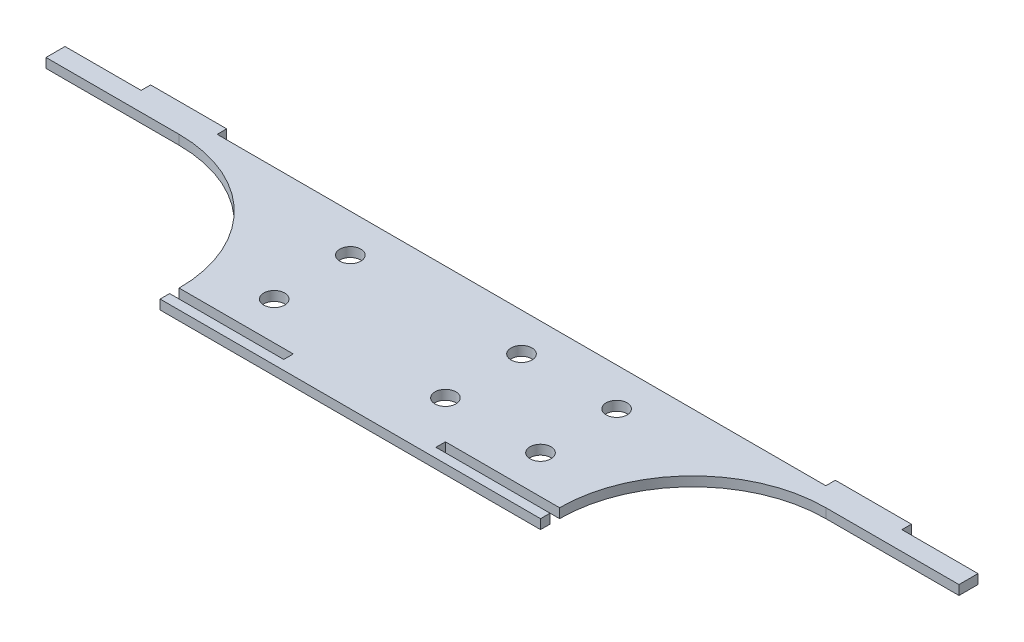
ISO-10303-21;
HEADER;
FILE_DESCRIPTION(('STEP AP214'),'2;1');
FILE_NAME('part.step','',(''),(''),'','','');
FILE_SCHEMA(('AUTOMOTIVE_DESIGN { 1 0 10303 214 1 1 1 1 }'));
ENDSEC;
DATA;
#1=APPLICATION_CONTEXT('core data for automotive mechanical design processes');
#2=APPLICATION_PROTOCOL_DEFINITION('international standard','automotive_design',2000,#1);
#3=PRODUCT_CONTEXT('',#1,'mechanical');
#4=PRODUCT('Part','Part','',(#3));
#5=PRODUCT_RELATED_PRODUCT_CATEGORY('part','',(#4));
#6=PRODUCT_DEFINITION_FORMATION('','',#4);
#7=PRODUCT_DEFINITION_CONTEXT('part definition',#1,'design');
#8=PRODUCT_DEFINITION('design','',#6,#7);
#9=PRODUCT_DEFINITION_SHAPE('','',#8);
#10=(LENGTH_UNIT() NAMED_UNIT(*) SI_UNIT(.MILLI.,.METRE.));
#11=(NAMED_UNIT(*) PLANE_ANGLE_UNIT() SI_UNIT($,.RADIAN.));
#12=(NAMED_UNIT(*) SI_UNIT($,.STERADIAN.) SOLID_ANGLE_UNIT());
#13=UNCERTAINTY_MEASURE_WITH_UNIT(LENGTH_MEASURE(1.E-05),#10,'distance_accuracy_value','');
#14=(GEOMETRIC_REPRESENTATION_CONTEXT(3) GLOBAL_UNCERTAINTY_ASSIGNED_CONTEXT((#13)) GLOBAL_UNIT_ASSIGNED_CONTEXT((#10,
#11,#12)) REPRESENTATION_CONTEXT('',''));
#15=CARTESIAN_POINT('',(0.,0.,0.));
#16=DIRECTION('',(0.,0.,1.));
#17=DIRECTION('',(1.,0.,0.));
#18=AXIS2_PLACEMENT_3D('',#15,#16,#17);
#19=CARTESIAN_POINT('',(0.,3.175,-19.05));
#20=DIRECTION('',(0.,0.,1.));
#21=DIRECTION('',(1.,0.,0.));
#22=AXIS2_PLACEMENT_3D('',#19,#20,#21);
#23=PLANE('',#22);
#24=DIRECTION('',(-1.,0.,0.));
#25=VECTOR('',#24,1.);
#26=CARTESIAN_POINT('',(0.,0.,-19.05));
#27=LINE('',#26,#25);
#28=CARTESIAN_POINT('',(-107.95,0.,-19.05));
#29=VERTEX_POINT('',#28);
#30=CARTESIAN_POINT('',(-152.4,0.,-19.05));
#31=VERTEX_POINT('',#30);
#32=EDGE_CURVE('E327',#29,#31,#27,.T.);
#33=ORIENTED_EDGE('',*,*,#32,.F.);
#34=DIRECTION('',(0.,-1.,0.));
#35=VECTOR('',#34,1.);
#36=CARTESIAN_POINT('',(-107.95,3.175,-19.05));
#37=LINE('',#36,#35);
#38=CARTESIAN_POINT('',(-107.95,3.175,-19.05));
#39=VERTEX_POINT('',#38);
#40=EDGE_CURVE('E343',#39,#29,#37,.T.);
#41=ORIENTED_EDGE('',*,*,#40,.F.);
#42=DIRECTION('',(-1.,0.,0.));
#43=VECTOR('',#42,1.);
#44=CARTESIAN_POINT('',(0.,3.175,-19.05));
#45=LINE('',#44,#43);
#46=CARTESIAN_POINT('',(-152.4,3.175,-19.05));
#47=VERTEX_POINT('',#46);
#48=EDGE_CURVE('E282',#39,#47,#45,.T.);
#49=ORIENTED_EDGE('',*,*,#48,.T.);
#50=DIRECTION('',(0.,-1.,0.));
#51=VECTOR('',#50,1.);
#52=CARTESIAN_POINT('',(-152.4,3.175,-19.05));
#53=LINE('',#52,#51);
#54=EDGE_CURVE('E346',#47,#31,#53,.T.);
#55=ORIENTED_EDGE('',*,*,#54,.T.);
#56=EDGE_LOOP('',(#33,#41,#49,#55));
#57=FACE_BOUND('',#56,.T.);
#58=ADVANCED_FACE('F115',(#57),#23,.T.);
#59=CARTESIAN_POINT('',(0.,3.175,-19.05));
#60=DIRECTION('',(0.,0.,1.));
#61=DIRECTION('',(1.,0.,0.));
#62=AXIS2_PLACEMENT_3D('',#59,#60,#61);
#63=PLANE('',#62);
#64=DIRECTION('',(-1.,0.,0.));
#65=VECTOR('',#64,1.);
#66=CARTESIAN_POINT('',(0.,0.,-19.05));
#67=LINE('',#66,#65);
#68=CARTESIAN_POINT('',(152.4,0.,-19.05));
#69=VERTEX_POINT('',#68);
#70=CARTESIAN_POINT('',(107.95,0.,-19.05));
#71=VERTEX_POINT('',#70);
#72=EDGE_CURVE('E314',#69,#71,#67,.T.);
#73=ORIENTED_EDGE('',*,*,#72,.F.);
#74=DIRECTION('',(0.,-1.,0.));
#75=VECTOR('',#74,1.);
#76=CARTESIAN_POINT('',(152.4,3.175,-19.05));
#77=LINE('',#76,#75);
#78=CARTESIAN_POINT('',(152.4,3.175,-19.05));
#79=VERTEX_POINT('',#78);
#80=EDGE_CURVE('E355',#79,#69,#77,.T.);
#81=ORIENTED_EDGE('',*,*,#80,.F.);
#82=DIRECTION('',(-1.,0.,0.));
#83=VECTOR('',#82,1.);
#84=CARTESIAN_POINT('',(0.,3.175,-19.05));
#85=LINE('',#84,#83);
#86=CARTESIAN_POINT('',(107.95,3.175,-19.05));
#87=VERTEX_POINT('',#86);
#88=EDGE_CURVE('E493',#79,#87,#85,.T.);
#89=ORIENTED_EDGE('',*,*,#88,.T.);
#90=DIRECTION('',(0.,-1.,0.));
#91=VECTOR('',#90,1.);
#92=CARTESIAN_POINT('',(107.95,3.175,-19.05));
#93=LINE('',#92,#91);
#94=EDGE_CURVE('E358',#87,#71,#93,.T.);
#95=ORIENTED_EDGE('',*,*,#94,.T.);
#96=EDGE_LOOP('',(#73,#81,#89,#95));
#97=FACE_BOUND('',#96,.T.);
#98=ADVANCED_FACE('F487',(#97),#63,.T.);
#99=CARTESIAN_POINT('',(-44.45,3.175,-12.7));
#100=DIRECTION('',(0.,-1.,0.));
#101=DIRECTION('',(0.,0.,-1.));
#102=AXIS2_PLACEMENT_3D('',#99,#100,#101);
#103=CYLINDRICAL_SURFACE('',#102,3.5);
#104=CARTESIAN_POINT('',(-44.45,3.175,-12.7));
#105=DIRECTION('',(0.,1.,0.));
#106=DIRECTION('',(0.,0.,1.));
#107=AXIS2_PLACEMENT_3D('',#104,#105,#106);
#108=CIRCLE('',#107,3.5);
#109=CARTESIAN_POINT('',(-44.45,3.175,-9.2));
#110=VERTEX_POINT('',#109);
#111=EDGE_CURVE('E551',#110,#110,#108,.T.);
#112=ORIENTED_EDGE('',*,*,#111,.T.);
#113=EDGE_LOOP('',(#112));
#114=FACE_BOUND('',#113,.T.);
#115=CARTESIAN_POINT('',(-44.45,0.,-12.7));
#116=DIRECTION('',(0.,1.,0.));
#117=DIRECTION('',(0.,0.,1.));
#118=AXIS2_PLACEMENT_3D('',#115,#116,#117);
#119=CIRCLE('',#118,3.5);
#120=CARTESIAN_POINT('',(-44.45,0.,-9.2));
#121=VERTEX_POINT('',#120);
#122=EDGE_CURVE('E309',#121,#121,#119,.T.);
#123=ORIENTED_EDGE('',*,*,#122,.F.);
#124=EDGE_LOOP('',(#123));
#125=FACE_BOUND('',#124,.T.);
#126=ADVANCED_FACE('F587',(#114,#125),#103,.F.);
#127=CARTESIAN_POINT('',(-44.45,3.175,12.7));
#128=DIRECTION('',(0.,-1.,0.));
#129=DIRECTION('',(0.,0.,-1.));
#130=AXIS2_PLACEMENT_3D('',#127,#128,#129);
#131=CYLINDRICAL_SURFACE('',#130,3.5);
#132=CARTESIAN_POINT('',(-44.45,3.175,12.7));
#133=DIRECTION('',(0.,1.,0.));
#134=DIRECTION('',(0.,0.,1.));
#135=AXIS2_PLACEMENT_3D('',#132,#133,#134);
#136=CIRCLE('',#135,3.5);
#137=CARTESIAN_POINT('',(-44.45,3.175,16.2));
#138=VERTEX_POINT('',#137);
#139=EDGE_CURVE('E554',#138,#138,#136,.T.);
#140=ORIENTED_EDGE('',*,*,#139,.T.);
#141=EDGE_LOOP('',(#140));
#142=FACE_BOUND('',#141,.T.);
#143=CARTESIAN_POINT('',(-44.45,0.,12.7));
#144=DIRECTION('',(0.,1.,0.));
#145=DIRECTION('',(0.,0.,1.));
#146=AXIS2_PLACEMENT_3D('',#143,#144,#145);
#147=CIRCLE('',#146,3.5);
#148=CARTESIAN_POINT('',(-44.45,0.,16.2));
#149=VERTEX_POINT('',#148);
#150=EDGE_CURVE('E306',#149,#149,#147,.T.);
#151=ORIENTED_EDGE('',*,*,#150,.F.);
#152=EDGE_LOOP('',(#151));
#153=FACE_BOUND('',#152,.T.);
#154=ADVANCED_FACE('F590',(#142,#153),#131,.F.);
#155=CARTESIAN_POINT('',(44.45,3.175,-12.7));
#156=DIRECTION('',(0.,-1.,0.));
#157=DIRECTION('',(0.,0.,-1.));
#158=AXIS2_PLACEMENT_3D('',#155,#156,#157);
#159=CYLINDRICAL_SURFACE('',#158,3.5);
#160=CARTESIAN_POINT('',(44.45,3.175,-12.7));
#161=DIRECTION('',(0.,1.,0.));
#162=DIRECTION('',(0.,0.,1.));
#163=AXIS2_PLACEMENT_3D('',#160,#161,#162);
#164=CIRCLE('',#163,3.5);
#165=CARTESIAN_POINT('',(44.45,3.175,-9.2));
#166=VERTEX_POINT('',#165);
#167=EDGE_CURVE('E559',#166,#166,#164,.T.);
#168=ORIENTED_EDGE('',*,*,#167,.T.);
#169=EDGE_LOOP('',(#168));
#170=FACE_BOUND('',#169,.T.);
#171=CARTESIAN_POINT('',(44.45,0.,-12.7));
#172=DIRECTION('',(0.,1.,0.));
#173=DIRECTION('',(0.,0.,1.));
#174=AXIS2_PLACEMENT_3D('',#171,#172,#173);
#175=CIRCLE('',#174,3.5);
#176=CARTESIAN_POINT('',(44.45,0.,-9.2));
#177=VERTEX_POINT('',#176);
#178=EDGE_CURVE('E303',#177,#177,#175,.T.);
#179=ORIENTED_EDGE('',*,*,#178,.F.);
#180=EDGE_LOOP('',(#179));
#181=FACE_BOUND('',#180,.T.);
#182=ADVANCED_FACE('F620',(#170,#181),#159,.F.);
#183=CARTESIAN_POINT('',(44.45,3.175,12.7));
#184=DIRECTION('',(0.,-1.,0.));
#185=DIRECTION('',(0.,0.,-1.));
#186=AXIS2_PLACEMENT_3D('',#183,#184,#185);
#187=CYLINDRICAL_SURFACE('',#186,3.5);
#188=CARTESIAN_POINT('',(44.45,3.175,12.7));
#189=DIRECTION('',(0.,1.,0.));
#190=DIRECTION('',(0.,0.,1.));
#191=AXIS2_PLACEMENT_3D('',#188,#189,#190);
#192=CIRCLE('',#191,3.5);
#193=CARTESIAN_POINT('',(44.45,3.175,16.2));
#194=VERTEX_POINT('',#193);
#195=EDGE_CURVE('E562',#194,#194,#192,.T.);
#196=ORIENTED_EDGE('',*,*,#195,.T.);
#197=EDGE_LOOP('',(#196));
#198=FACE_BOUND('',#197,.T.);
#199=CARTESIAN_POINT('',(44.45,0.,12.7));
#200=DIRECTION('',(0.,1.,0.));
#201=DIRECTION('',(0.,0.,1.));
#202=AXIS2_PLACEMENT_3D('',#199,#200,#201);
#203=CIRCLE('',#202,3.5);
#204=CARTESIAN_POINT('',(44.45,0.,16.2));
#205=VERTEX_POINT('',#204);
#206=EDGE_CURVE('E300',#205,#205,#203,.T.);
#207=ORIENTED_EDGE('',*,*,#206,.F.);
#208=EDGE_LOOP('',(#207));
#209=FACE_BOUND('',#208,.T.);
#210=ADVANCED_FACE('F624',(#198,#209),#187,.F.);
#211=CARTESIAN_POINT('',(12.7,3.175,-12.7));
#212=DIRECTION('',(0.,-1.,0.));
#213=DIRECTION('',(0.,0.,-1.));
#214=AXIS2_PLACEMENT_3D('',#211,#212,#213);
#215=CYLINDRICAL_SURFACE('',#214,3.5);
#216=CARTESIAN_POINT('',(12.7,3.175,-12.7));
#217=DIRECTION('',(0.,1.,0.));
#218=DIRECTION('',(0.,0.,1.));
#219=AXIS2_PLACEMENT_3D('',#216,#217,#218);
#220=CIRCLE('',#219,3.5);
#221=CARTESIAN_POINT('',(12.7,3.175,-9.2));
#222=VERTEX_POINT('',#221);
#223=EDGE_CURVE('E565',#222,#222,#220,.T.);
#224=ORIENTED_EDGE('',*,*,#223,.T.);
#225=EDGE_LOOP('',(#224));
#226=FACE_BOUND('',#225,.T.);
#227=CARTESIAN_POINT('',(12.7,0.,-12.7));
#228=DIRECTION('',(0.,1.,0.));
#229=DIRECTION('',(0.,0.,1.));
#230=AXIS2_PLACEMENT_3D('',#227,#228,#229);
#231=CIRCLE('',#230,3.5);
#232=CARTESIAN_POINT('',(12.7,0.,-9.2));
#233=VERTEX_POINT('',#232);
#234=EDGE_CURVE('E296',#233,#233,#231,.T.);
#235=ORIENTED_EDGE('',*,*,#234,.F.);
#236=EDGE_LOOP('',(#235));
#237=FACE_BOUND('',#236,.T.);
#238=ADVANCED_FACE('F628',(#226,#237),#215,.F.);
#239=CARTESIAN_POINT('',(12.7,3.175,12.7));
#240=DIRECTION('',(0.,-1.,0.));
#241=DIRECTION('',(0.,0.,-1.));
#242=AXIS2_PLACEMENT_3D('',#239,#240,#241);
#243=CYLINDRICAL_SURFACE('',#242,3.5);
#244=CARTESIAN_POINT('',(12.7,3.175,12.7));
#245=DIRECTION('',(0.,1.,0.));
#246=DIRECTION('',(0.,0.,1.));
#247=AXIS2_PLACEMENT_3D('',#244,#245,#246);
#248=CIRCLE('',#247,3.5);
#249=CARTESIAN_POINT('',(12.7,3.175,16.2));
#250=VERTEX_POINT('',#249);
#251=EDGE_CURVE('E337',#250,#250,#248,.T.);
#252=ORIENTED_EDGE('',*,*,#251,.T.);
#253=EDGE_LOOP('',(#252));
#254=FACE_BOUND('',#253,.T.);
#255=CARTESIAN_POINT('',(12.7,0.,12.7));
#256=DIRECTION('',(0.,1.,0.));
#257=DIRECTION('',(0.,0.,1.));
#258=AXIS2_PLACEMENT_3D('',#255,#256,#257);
#259=CIRCLE('',#258,3.5);
#260=CARTESIAN_POINT('',(12.7,0.,16.2));
#261=VERTEX_POINT('',#260);
#262=EDGE_CURVE('E293',#261,#261,#259,.T.);
#263=ORIENTED_EDGE('',*,*,#262,.F.);
#264=EDGE_LOOP('',(#263));
#265=FACE_BOUND('',#264,.T.);
#266=ADVANCED_FACE('F571',(#254,#265),#243,.F.);
#267=CARTESIAN_POINT('',(-152.4,3.175,0.));
#268=DIRECTION('',(-1.,0.,0.));
#269=DIRECTION('',(0.,0.,1.));
#270=AXIS2_PLACEMENT_3D('',#267,#268,#269);
#271=PLANE('',#270);
#272=DIRECTION('',(0.,0.,-1.));
#273=VECTOR('',#272,1.);
#274=CARTESIAN_POINT('',(-152.4,0.,0.));
#275=LINE('',#274,#273);
#276=CARTESIAN_POINT('',(-152.4,0.,-25.4));
#277=VERTEX_POINT('',#276);
#278=EDGE_CURVE('E324',#31,#277,#275,.T.);
#279=ORIENTED_EDGE('',*,*,#278,.F.);
#280=ORIENTED_EDGE('',*,*,#54,.F.);
#281=DIRECTION('',(0.,0.,-1.));
#282=VECTOR('',#281,1.);
#283=CARTESIAN_POINT('',(-152.4,3.175,0.));
#284=LINE('',#283,#282);
#285=CARTESIAN_POINT('',(-152.4,3.175,-25.4));
#286=VERTEX_POINT('',#285);
#287=EDGE_CURVE('E275',#47,#286,#284,.T.);
#288=ORIENTED_EDGE('',*,*,#287,.T.);
#289=DIRECTION('',(0.,-1.,0.));
#290=VECTOR('',#289,1.);
#291=CARTESIAN_POINT('',(-152.4,3.175,-25.4));
#292=LINE('',#291,#290);
#293=EDGE_CURVE('E349',#286,#277,#292,.T.);
#294=ORIENTED_EDGE('',*,*,#293,.T.);
#295=EDGE_LOOP('',(#279,#280,#288,#294));
#296=FACE_BOUND('',#295,.T.);
#297=ADVANCED_FACE('F441',(#296),#271,.T.);
#298=CARTESIAN_POINT('',(152.4,3.175,0.));
#299=DIRECTION('',(-1.,0.,0.));
#300=DIRECTION('',(0.,0.,1.));
#301=AXIS2_PLACEMENT_3D('',#298,#299,#300);
#302=PLANE('',#301);
#303=DIRECTION('',(0.,0.,-1.));
#304=VECTOR('',#303,1.);
#305=CARTESIAN_POINT('',(152.4,0.,0.));
#306=LINE('',#305,#304);
#307=CARTESIAN_POINT('',(152.4,0.,-25.4));
#308=VERTEX_POINT('',#307);
#309=EDGE_CURVE('E317',#69,#308,#306,.T.);
#310=ORIENTED_EDGE('',*,*,#309,.T.);
#311=DIRECTION('',(0.,-1.,0.));
#312=VECTOR('',#311,1.);
#313=CARTESIAN_POINT('',(152.4,3.175,-25.4));
#314=LINE('',#313,#312);
#315=CARTESIAN_POINT('',(152.4,3.175,-25.4));
#316=VERTEX_POINT('',#315);
#317=EDGE_CURVE('E352',#316,#308,#314,.T.);
#318=ORIENTED_EDGE('',*,*,#317,.F.);
#319=DIRECTION('',(0.,0.,-1.));
#320=VECTOR('',#319,1.);
#321=CARTESIAN_POINT('',(152.4,3.175,0.));
#322=LINE('',#321,#320);
#323=EDGE_CURVE('E276',#79,#316,#322,.T.);
#324=ORIENTED_EDGE('',*,*,#323,.F.);
#325=ORIENTED_EDGE('',*,*,#80,.T.);
#326=EDGE_LOOP('',(#310,#318,#324,#325));
#327=FACE_BOUND('',#326,.T.);
#328=ADVANCED_FACE('F483',(#327),#302,.F.);
#329=CARTESIAN_POINT('',(-107.95,3.175,25.4));
#330=DIRECTION('',(0.,-1.,0.));
#331=DIRECTION('',(0.,0.,-1.));
#332=AXIS2_PLACEMENT_3D('',#329,#330,#331);
#333=CYLINDRICAL_SURFACE('',#332,44.45);
#334=CARTESIAN_POINT('',(-107.95,0.,25.4));
#335=DIRECTION('',(0.,1.,0.));
#336=DIRECTION('',(0.,0.,1.));
#337=AXIS2_PLACEMENT_3D('',#334,#335,#336);
#338=CIRCLE('',#337,44.45);
#339=CARTESIAN_POINT('',(-63.5,0.,25.4));
#340=VERTEX_POINT('',#339);
#341=EDGE_CURVE('E330',#29,#340,#338,.F.);
#342=ORIENTED_EDGE('',*,*,#341,.T.);
#343=DIRECTION('',(0.,-1.,0.));
#344=VECTOR('',#343,1.);
#345=CARTESIAN_POINT('',(-63.5,3.175,25.4));
#346=LINE('',#345,#344);
#347=CARTESIAN_POINT('',(-63.5,3.175,25.4));
#348=VERTEX_POINT('',#347);
#349=EDGE_CURVE('E340',#348,#340,#346,.T.);
#350=ORIENTED_EDGE('',*,*,#349,.F.);
#351=CARTESIAN_POINT('',(-107.95,3.175,25.4));
#352=DIRECTION('',(0.,1.,0.));
#353=DIRECTION('',(0.,0.,1.));
#354=AXIS2_PLACEMENT_3D('',#351,#352,#353);
#355=CIRCLE('',#354,44.45);
#356=EDGE_CURVE('E285',#39,#348,#355,.F.);
#357=ORIENTED_EDGE('',*,*,#356,.F.);
#358=ORIENTED_EDGE('',*,*,#40,.T.);
#359=EDGE_LOOP('',(#342,#350,#357,#358));
#360=FACE_BOUND('',#359,.T.);
#361=ADVANCED_FACE('F600',(#360),#333,.F.);
#362=CARTESIAN_POINT('',(107.95,3.175,25.4));
#363=DIRECTION('',(0.,-1.,0.));
#364=DIRECTION('',(0.,0.,-1.));
#365=AXIS2_PLACEMENT_3D('',#362,#363,#364);
#366=CYLINDRICAL_SURFACE('',#365,44.45);
#367=CARTESIAN_POINT('',(107.95,0.,25.4));
#368=DIRECTION('',(0.,1.,0.));
#369=DIRECTION('',(0.,0.,1.));
#370=AXIS2_PLACEMENT_3D('',#367,#368,#369);
#371=CIRCLE('',#370,44.45);
#372=CARTESIAN_POINT('',(63.5,0.,25.4));
#373=VERTEX_POINT('',#372);
#374=EDGE_CURVE('E312',#71,#373,#371,.T.);
#375=ORIENTED_EDGE('',*,*,#374,.F.);
#376=ORIENTED_EDGE('',*,*,#94,.F.);
#377=CARTESIAN_POINT('',(107.95,3.175,25.4));
#378=DIRECTION('',(0.,1.,0.));
#379=DIRECTION('',(0.,0.,1.));
#380=AXIS2_PLACEMENT_3D('',#377,#378,#379);
#381=CIRCLE('',#380,44.45);
#382=CARTESIAN_POINT('',(63.5,3.175,25.4));
#383=VERTEX_POINT('',#382);
#384=EDGE_CURVE('E549',#87,#383,#381,.T.);
#385=ORIENTED_EDGE('',*,*,#384,.T.);
#386=DIRECTION('',(0.,-1.,0.));
#387=VECTOR('',#386,1.);
#388=CARTESIAN_POINT('',(63.5,3.175,25.4));
#389=LINE('',#388,#387);
#390=EDGE_CURVE('E292',#383,#373,#389,.T.);
#391=ORIENTED_EDGE('',*,*,#390,.T.);
#392=EDGE_LOOP('',(#375,#376,#385,#391));
#393=FACE_BOUND('',#392,.T.);
#394=ADVANCED_FACE('F497',(#393),#366,.F.);
#395=CARTESIAN_POINT('',(0.,0.,0.));
#396=DIRECTION('',(0.,1.,0.));
#397=DIRECTION('',(0.,0.,1.));
#398=AXIS2_PLACEMENT_3D('',#395,#396,#397);
#399=PLANE('',#398);
#400=ORIENTED_EDGE('',*,*,#262,.T.);
#401=EDGE_LOOP('',(#400));
#402=FACE_BOUND('',#401,.T.);
#403=ORIENTED_EDGE('',*,*,#234,.T.);
#404=EDGE_LOOP('',(#403));
#405=FACE_BOUND('',#404,.T.);
#406=ORIENTED_EDGE('',*,*,#206,.T.);
#407=EDGE_LOOP('',(#406));
#408=FACE_BOUND('',#407,.T.);
#409=ORIENTED_EDGE('',*,*,#178,.T.);
#410=EDGE_LOOP('',(#409));
#411=FACE_BOUND('',#410,.T.);
#412=ORIENTED_EDGE('',*,*,#150,.T.);
#413=EDGE_LOOP('',(#412));
#414=FACE_BOUND('',#413,.T.);
#415=ORIENTED_EDGE('',*,*,#122,.T.);
#416=EDGE_LOOP('',(#415));
#417=FACE_BOUND('',#416,.T.);
#418=ORIENTED_EDGE('',*,*,#374,.T.);
#419=DIRECTION('',(1.,0.,0.));
#420=VECTOR('',#419,1.);
#421=CARTESIAN_POINT('',(0.,0.,25.4));
#422=LINE('',#421,#420);
#423=CARTESIAN_POINT('',(25.4,0.,25.4));
#424=VERTEX_POINT('',#423);
#425=EDGE_CURVE('E333',#424,#373,#422,.T.);
#426=ORIENTED_EDGE('',*,*,#425,.F.);
#427=DIRECTION('',(0.,0.,1.));
#428=VECTOR('',#427,1.);
#429=CARTESIAN_POINT('',(25.4,0.,25.4));
#430=LINE('',#429,#428);
#431=CARTESIAN_POINT('',(25.4,0.,28.575));
#432=VERTEX_POINT('',#431);
#433=EDGE_CURVE('E255',#424,#432,#430,.T.);
#434=ORIENTED_EDGE('',*,*,#433,.T.);
#435=DIRECTION('',(1.,0.,0.));
#436=VECTOR('',#435,1.);
#437=CARTESIAN_POINT('',(0.,0.,28.575));
#438=LINE('',#437,#436);
#439=CARTESIAN_POINT('',(63.5,0.,28.575));
#440=VERTEX_POINT('',#439);
#441=EDGE_CURVE('E384',#432,#440,#438,.T.);
#442=ORIENTED_EDGE('',*,*,#441,.T.);
#443=DIRECTION('',(0.,0.,-1.));
#444=VECTOR('',#443,1.);
#445=CARTESIAN_POINT('',(63.5,0.,0.));
#446=LINE('',#445,#444);
#447=CARTESIAN_POINT('',(63.5,0.,31.75));
#448=VERTEX_POINT('',#447);
#449=EDGE_CURVE('E380',#448,#440,#446,.T.);
#450=ORIENTED_EDGE('',*,*,#449,.F.);
#451=DIRECTION('',(1.,0.,0.));
#452=VECTOR('',#451,1.);
#453=CARTESIAN_POINT('',(0.,0.,31.75));
#454=LINE('',#453,#452);
#455=CARTESIAN_POINT('',(-63.5,0.,31.75));
#456=VERTEX_POINT('',#455);
#457=EDGE_CURVE('E377',#456,#448,#454,.T.);
#458=ORIENTED_EDGE('',*,*,#457,.F.);
#459=DIRECTION('',(0.,0.,-1.));
#460=VECTOR('',#459,1.);
#461=CARTESIAN_POINT('',(-63.5,0.,0.));
#462=LINE('',#461,#460);
#463=CARTESIAN_POINT('',(-63.5,0.,28.575));
#464=VERTEX_POINT('',#463);
#465=EDGE_CURVE('E366',#456,#464,#462,.T.);
#466=ORIENTED_EDGE('',*,*,#465,.T.);
#467=CARTESIAN_POINT('',(-25.4,0.,28.575));
#468=VERTEX_POINT('',#467);
#469=EDGE_CURVE('E385',#464,#468,#438,.T.);
#470=ORIENTED_EDGE('',*,*,#469,.T.);
#471=DIRECTION('',(0.,0.,1.));
#472=VECTOR('',#471,1.);
#473=CARTESIAN_POINT('',(-25.4,0.,25.4));
#474=LINE('',#473,#472);
#475=CARTESIAN_POINT('',(-25.4,0.,25.4));
#476=VERTEX_POINT('',#475);
#477=EDGE_CURVE('E403',#476,#468,#474,.T.);
#478=ORIENTED_EDGE('',*,*,#477,.F.);
#479=EDGE_CURVE('E334',#340,#476,#422,.T.);
#480=ORIENTED_EDGE('',*,*,#479,.F.);
#481=ORIENTED_EDGE('',*,*,#341,.F.);
#482=ORIENTED_EDGE('',*,*,#32,.T.);
#483=ORIENTED_EDGE('',*,*,#278,.T.);
#484=DIRECTION('',(1.,0.,0.));
#485=VECTOR('',#484,1.);
#486=CARTESIAN_POINT('',(0.,0.,-25.4));
#487=LINE('',#486,#485);
#488=CARTESIAN_POINT('',(-127.,0.,-25.4));
#489=VERTEX_POINT('',#488);
#490=EDGE_CURVE('E321',#277,#489,#487,.T.);
#491=ORIENTED_EDGE('',*,*,#490,.T.);
#492=DIRECTION('',(0.,0.,1.));
#493=VECTOR('',#492,1.);
#494=CARTESIAN_POINT('',(-127.,0.,-28.575));
#495=LINE('',#494,#493);
#496=CARTESIAN_POINT('',(-127.,0.,-28.575));
#497=VERTEX_POINT('',#496);
#498=EDGE_CURVE('E241',#497,#489,#495,.T.);
#499=ORIENTED_EDGE('',*,*,#498,.F.);
#500=DIRECTION('',(1.,0.,0.));
#501=VECTOR('',#500,1.);
#502=CARTESIAN_POINT('',(-127.,0.,-28.575));
#503=LINE('',#502,#501);
#504=CARTESIAN_POINT('',(-101.6,0.,-28.575));
#505=VERTEX_POINT('',#504);
#506=EDGE_CURVE('E236',#497,#505,#503,.T.);
#507=ORIENTED_EDGE('',*,*,#506,.T.);
#508=DIRECTION('',(0.,0.,1.));
#509=VECTOR('',#508,1.);
#510=CARTESIAN_POINT('',(-101.6,0.,-28.575));
#511=LINE('',#510,#509);
#512=CARTESIAN_POINT('',(-101.6,0.,-25.4));
#513=VERTEX_POINT('',#512);
#514=EDGE_CURVE('E235',#505,#513,#511,.T.);
#515=ORIENTED_EDGE('',*,*,#514,.T.);
#516=CARTESIAN_POINT('',(101.6,0.,-25.4));
#517=VERTEX_POINT('',#516);
#518=EDGE_CURVE('E223',#513,#517,#487,.T.);
#519=ORIENTED_EDGE('',*,*,#518,.T.);
#520=DIRECTION('',(0.,0.,1.));
#521=VECTOR('',#520,1.);
#522=CARTESIAN_POINT('',(101.6,0.,-28.575));
#523=LINE('',#522,#521);
#524=CARTESIAN_POINT('',(101.6,0.,-28.575));
#525=VERTEX_POINT('',#524);
#526=EDGE_CURVE('E209',#525,#517,#523,.T.);
#527=ORIENTED_EDGE('',*,*,#526,.F.);
#528=DIRECTION('',(1.,0.,0.));
#529=VECTOR('',#528,1.);
#530=CARTESIAN_POINT('',(101.6,0.,-28.575));
#531=LINE('',#530,#529);
#532=CARTESIAN_POINT('',(127.,0.,-28.575));
#533=VERTEX_POINT('',#532);
#534=EDGE_CURVE('E220',#525,#533,#531,.T.);
#535=ORIENTED_EDGE('',*,*,#534,.T.);
#536=DIRECTION('',(0.,0.,1.));
#537=VECTOR('',#536,1.);
#538=CARTESIAN_POINT('',(127.,0.,-28.575));
#539=LINE('',#538,#537);
#540=CARTESIAN_POINT('',(127.,0.,-25.4));
#541=VERTEX_POINT('',#540);
#542=EDGE_CURVE('E227',#533,#541,#539,.T.);
#543=ORIENTED_EDGE('',*,*,#542,.T.);
#544=EDGE_CURVE('E320',#541,#308,#487,.T.);
#545=ORIENTED_EDGE('',*,*,#544,.T.);
#546=ORIENTED_EDGE('',*,*,#309,.F.);
#547=ORIENTED_EDGE('',*,*,#72,.T.);
#548=EDGE_LOOP('',(#418,#426,#434,#442,#450,#458,#466,#470,#478,#480,#481,#482,#483,#491,#499,
#507,#515,#519,#527,#535,#543,#545,#546,#547));
#549=FACE_BOUND('',#548,.T.);
#550=ADVANCED_FACE('F218',(#402,#405,#408,#411,#414,#417,#549),#399,.F.);
#551=CARTESIAN_POINT('',(0.,3.175,0.));
#552=DIRECTION('',(0.,1.,0.));
#553=DIRECTION('',(0.,0.,1.));
#554=AXIS2_PLACEMENT_3D('',#551,#552,#553);
#555=PLANE('',#554);
#556=ORIENTED_EDGE('',*,*,#251,.F.);
#557=EDGE_LOOP('',(#556));
#558=FACE_BOUND('',#557,.T.);
#559=ORIENTED_EDGE('',*,*,#223,.F.);
#560=EDGE_LOOP('',(#559));
#561=FACE_BOUND('',#560,.T.);
#562=ORIENTED_EDGE('',*,*,#195,.F.);
#563=EDGE_LOOP('',(#562));
#564=FACE_BOUND('',#563,.T.);
#565=ORIENTED_EDGE('',*,*,#167,.F.);
#566=EDGE_LOOP('',(#565));
#567=FACE_BOUND('',#566,.T.);
#568=ORIENTED_EDGE('',*,*,#139,.F.);
#569=EDGE_LOOP('',(#568));
#570=FACE_BOUND('',#569,.T.);
#571=ORIENTED_EDGE('',*,*,#111,.F.);
#572=EDGE_LOOP('',(#571));
#573=FACE_BOUND('',#572,.T.);
#574=ORIENTED_EDGE('',*,*,#384,.F.);
#575=ORIENTED_EDGE('',*,*,#88,.F.);
#576=ORIENTED_EDGE('',*,*,#323,.T.);
#577=DIRECTION('',(1.,0.,0.));
#578=VECTOR('',#577,1.);
#579=CARTESIAN_POINT('',(0.,3.175,-25.4));
#580=LINE('',#579,#578);
#581=CARTESIAN_POINT('',(127.,3.175,-25.4));
#582=VERTEX_POINT('',#581);
#583=EDGE_CURVE('E272',#582,#316,#580,.T.);
#584=ORIENTED_EDGE('',*,*,#583,.F.);
#585=DIRECTION('',(0.,0.,1.));
#586=VECTOR('',#585,1.);
#587=CARTESIAN_POINT('',(127.,3.175,-28.575));
#588=LINE('',#587,#586);
#589=CARTESIAN_POINT('',(127.,3.175,-28.575));
#590=VERTEX_POINT('',#589);
#591=EDGE_CURVE('E224',#590,#582,#588,.T.);
#592=ORIENTED_EDGE('',*,*,#591,.F.);
#593=DIRECTION('',(1.,0.,0.));
#594=VECTOR('',#593,1.);
#595=CARTESIAN_POINT('',(101.6,3.175,-28.575));
#596=LINE('',#595,#594);
#597=CARTESIAN_POINT('',(101.6,3.175,-28.575));
#598=VERTEX_POINT('',#597);
#599=EDGE_CURVE('E258',#598,#590,#596,.T.);
#600=ORIENTED_EDGE('',*,*,#599,.F.);
#601=DIRECTION('',(0.,0.,1.));
#602=VECTOR('',#601,1.);
#603=CARTESIAN_POINT('',(101.6,3.175,-28.575));
#604=LINE('',#603,#602);
#605=CARTESIAN_POINT('',(101.6,3.175,-25.4));
#606=VERTEX_POINT('',#605);
#607=EDGE_CURVE('E212',#598,#606,#604,.T.);
#608=ORIENTED_EDGE('',*,*,#607,.T.);
#609=CARTESIAN_POINT('',(-101.6,3.175,-25.4));
#610=VERTEX_POINT('',#609);
#611=EDGE_CURVE('E265',#610,#606,#580,.T.);
#612=ORIENTED_EDGE('',*,*,#611,.F.);
#613=DIRECTION('',(0.,0.,1.));
#614=VECTOR('',#613,1.);
#615=CARTESIAN_POINT('',(-101.6,3.175,-28.575));
#616=LINE('',#615,#614);
#617=CARTESIAN_POINT('',(-101.6,3.175,-28.575));
#618=VERTEX_POINT('',#617);
#619=EDGE_CURVE('E249',#618,#610,#616,.T.);
#620=ORIENTED_EDGE('',*,*,#619,.F.);
#621=DIRECTION('',(1.,0.,0.));
#622=VECTOR('',#621,1.);
#623=CARTESIAN_POINT('',(-127.,3.175,-28.575));
#624=LINE('',#623,#622);
#625=CARTESIAN_POINT('',(-127.,3.175,-28.575));
#626=VERTEX_POINT('',#625);
#627=EDGE_CURVE('E416',#626,#618,#624,.T.);
#628=ORIENTED_EDGE('',*,*,#627,.F.);
#629=DIRECTION('',(0.,0.,1.));
#630=VECTOR('',#629,1.);
#631=CARTESIAN_POINT('',(-127.,3.175,-28.575));
#632=LINE('',#631,#630);
#633=CARTESIAN_POINT('',(-127.,3.175,-25.4));
#634=VERTEX_POINT('',#633);
#635=EDGE_CURVE('E244',#626,#634,#632,.T.);
#636=ORIENTED_EDGE('',*,*,#635,.T.);
#637=EDGE_CURVE('E271',#286,#634,#580,.T.);
#638=ORIENTED_EDGE('',*,*,#637,.F.);
#639=ORIENTED_EDGE('',*,*,#287,.F.);
#640=ORIENTED_EDGE('',*,*,#48,.F.);
#641=ORIENTED_EDGE('',*,*,#356,.T.);
#642=DIRECTION('',(1.,0.,0.));
#643=VECTOR('',#642,1.);
#644=CARTESIAN_POINT('',(0.,3.175,25.4));
#645=LINE('',#644,#643);
#646=CARTESIAN_POINT('',(-25.4,3.175,25.4));
#647=VERTEX_POINT('',#646);
#648=EDGE_CURVE('E289',#348,#647,#645,.T.);
#649=ORIENTED_EDGE('',*,*,#648,.T.);
#650=DIRECTION('',(0.,0.,1.));
#651=VECTOR('',#650,1.);
#652=CARTESIAN_POINT('',(-25.4,3.175,25.4));
#653=LINE('',#652,#651);
#654=CARTESIAN_POINT('',(-25.4,3.175,28.575));
#655=VERTEX_POINT('',#654);
#656=EDGE_CURVE('E381',#647,#655,#653,.T.);
#657=ORIENTED_EDGE('',*,*,#656,.T.);
#658=DIRECTION('',(1.,0.,0.));
#659=VECTOR('',#658,1.);
#660=CARTESIAN_POINT('',(0.,3.175,28.575));
#661=LINE('',#660,#659);
#662=CARTESIAN_POINT('',(-63.5,3.175,28.575));
#663=VERTEX_POINT('',#662);
#664=EDGE_CURVE('E370',#663,#655,#661,.T.);
#665=ORIENTED_EDGE('',*,*,#664,.F.);
#666=DIRECTION('',(0.,0.,-1.));
#667=VECTOR('',#666,1.);
#668=CARTESIAN_POINT('',(-63.5,3.175,0.));
#669=LINE('',#668,#667);
#670=CARTESIAN_POINT('',(-63.5,3.175,31.75));
#671=VERTEX_POINT('',#670);
#672=EDGE_CURVE('E373',#671,#663,#669,.T.);
#673=ORIENTED_EDGE('',*,*,#672,.F.);
#674=DIRECTION('',(1.,0.,0.));
#675=VECTOR('',#674,1.);
#676=CARTESIAN_POINT('',(0.,3.175,31.75));
#677=LINE('',#676,#675);
#678=CARTESIAN_POINT('',(63.5,3.175,31.75));
#679=VERTEX_POINT('',#678);
#680=EDGE_CURVE('E362',#671,#679,#677,.T.);
#681=ORIENTED_EDGE('',*,*,#680,.T.);
#682=DIRECTION('',(0.,0.,-1.));
#683=VECTOR('',#682,1.);
#684=CARTESIAN_POINT('',(63.5,3.175,0.));
#685=LINE('',#684,#683);
#686=CARTESIAN_POINT('',(63.5,3.175,28.575));
#687=VERTEX_POINT('',#686);
#688=EDGE_CURVE('E365',#679,#687,#685,.T.);
#689=ORIENTED_EDGE('',*,*,#688,.T.);
#690=CARTESIAN_POINT('',(25.4,3.175,28.575));
#691=VERTEX_POINT('',#690);
#692=EDGE_CURVE('E369',#691,#687,#661,.T.);
#693=ORIENTED_EDGE('',*,*,#692,.F.);
#694=DIRECTION('',(0.,0.,1.));
#695=VECTOR('',#694,1.);
#696=CARTESIAN_POINT('',(25.4,3.175,25.4));
#697=LINE('',#696,#695);
#698=CARTESIAN_POINT('',(25.4,3.175,25.4));
#699=VERTEX_POINT('',#698);
#700=EDGE_CURVE('E400',#699,#691,#697,.T.);
#701=ORIENTED_EDGE('',*,*,#700,.F.);
#702=EDGE_CURVE('E288',#699,#383,#645,.T.);
#703=ORIENTED_EDGE('',*,*,#702,.T.);
#704=EDGE_LOOP('',(#574,#575,#576,#584,#592,#600,#608,#612,#620,#628,#636,#638,#639,#640,#641,
#649,#657,#665,#673,#681,#689,#693,#701,#703));
#705=FACE_BOUND('',#704,.T.);
#706=ADVANCED_FACE('F263',(#558,#561,#564,#567,#570,#573,#705),#555,.T.);
#707=CARTESIAN_POINT('',(0.,3.175,25.4));
#708=DIRECTION('',(0.,0.,-1.));
#709=DIRECTION('',(-1.,0.,0.));
#710=AXIS2_PLACEMENT_3D('',#707,#708,#709);
#711=PLANE('',#710);
#712=ORIENTED_EDGE('',*,*,#702,.F.);
#713=DIRECTION('',(0.,-1.,0.));
#714=VECTOR('',#713,1.);
#715=CARTESIAN_POINT('',(25.4,3.175,25.4));
#716=LINE('',#715,#714);
#717=EDGE_CURVE('E361',#699,#424,#716,.T.);
#718=ORIENTED_EDGE('',*,*,#717,.T.);
#719=ORIENTED_EDGE('',*,*,#425,.T.);
#720=ORIENTED_EDGE('',*,*,#390,.F.);
#721=EDGE_LOOP('',(#712,#718,#719,#720));
#722=FACE_BOUND('',#721,.T.);
#723=ADVANCED_FACE('F504',(#722),#711,.F.);
#724=DIRECTION('',(0.,-1.,0.));
#725=VECTOR('',#724,1.);
#726=CARTESIAN_POINT('',(-25.4,3.175,25.4));
#727=LINE('',#726,#725);
#728=EDGE_CURVE('E234',#647,#476,#727,.T.);
#729=ORIENTED_EDGE('',*,*,#728,.F.);
#730=ORIENTED_EDGE('',*,*,#648,.F.);
#731=ORIENTED_EDGE('',*,*,#349,.T.);
#732=ORIENTED_EDGE('',*,*,#479,.T.);
#733=EDGE_LOOP('',(#729,#730,#731,#732));
#734=FACE_BOUND('',#733,.T.);
#735=ADVANCED_FACE('F534',(#734),#711,.F.);
#736=CARTESIAN_POINT('',(0.,3.175,-25.4));
#737=DIRECTION('',(0.,0.,-1.));
#738=DIRECTION('',(-1.,0.,0.));
#739=AXIS2_PLACEMENT_3D('',#736,#737,#738);
#740=PLANE('',#739);
#741=DIRECTION('',(0.,-1.,0.));
#742=VECTOR('',#741,1.);
#743=CARTESIAN_POINT('',(-101.6,3.175,-25.4));
#744=LINE('',#743,#742);
#745=EDGE_CURVE('E12',#610,#513,#744,.T.);
#746=ORIENTED_EDGE('',*,*,#745,.F.);
#747=ORIENTED_EDGE('',*,*,#611,.T.);
#748=DIRECTION('',(0.,-1.,0.));
#749=VECTOR('',#748,1.);
#750=CARTESIAN_POINT('',(101.6,3.175,-25.4));
#751=LINE('',#750,#749);
#752=EDGE_CURVE('E232',#606,#517,#751,.T.);
#753=ORIENTED_EDGE('',*,*,#752,.T.);
#754=ORIENTED_EDGE('',*,*,#518,.F.);
#755=EDGE_LOOP('',(#746,#747,#753,#754));
#756=FACE_BOUND('',#755,.T.);
#757=ADVANCED_FACE('F269',(#756),#740,.T.);
#758=DIRECTION('',(0.,-1.,0.));
#759=VECTOR('',#758,1.);
#760=CARTESIAN_POINT('',(127.,3.175,-25.4));
#761=LINE('',#760,#759);
#762=EDGE_CURVE('E119',#582,#541,#761,.T.);
#763=ORIENTED_EDGE('',*,*,#762,.F.);
#764=ORIENTED_EDGE('',*,*,#583,.T.);
#765=ORIENTED_EDGE('',*,*,#317,.T.);
#766=ORIENTED_EDGE('',*,*,#544,.F.);
#767=EDGE_LOOP('',(#763,#764,#765,#766));
#768=FACE_BOUND('',#767,.T.);
#769=ADVANCED_FACE('F478',(#768),#740,.T.);
#770=ORIENTED_EDGE('',*,*,#637,.T.);
#771=DIRECTION('',(0.,-1.,0.));
#772=VECTOR('',#771,1.);
#773=CARTESIAN_POINT('',(-127.,3.175,-25.4));
#774=LINE('',#773,#772);
#775=EDGE_CURVE('E125',#634,#489,#774,.T.);
#776=ORIENTED_EDGE('',*,*,#775,.T.);
#777=ORIENTED_EDGE('',*,*,#490,.F.);
#778=ORIENTED_EDGE('',*,*,#293,.F.);
#779=EDGE_LOOP('',(#770,#776,#777,#778));
#780=FACE_BOUND('',#779,.T.);
#781=ADVANCED_FACE('F432',(#780),#740,.T.);
#782=CARTESIAN_POINT('',(0.,3.175,31.75));
#783=DIRECTION('',(0.,0.,-1.));
#784=DIRECTION('',(-1.,0.,0.));
#785=AXIS2_PLACEMENT_3D('',#782,#783,#784);
#786=PLANE('',#785);
#787=ORIENTED_EDGE('',*,*,#457,.T.);
#788=DIRECTION('',(0.,-1.,0.));
#789=VECTOR('',#788,1.);
#790=CARTESIAN_POINT('',(63.5,3.175,31.75));
#791=LINE('',#790,#789);
#792=EDGE_CURVE('E396',#679,#448,#791,.T.);
#793=ORIENTED_EDGE('',*,*,#792,.F.);
#794=ORIENTED_EDGE('',*,*,#680,.F.);
#795=DIRECTION('',(0.,-1.,0.));
#796=VECTOR('',#795,1.);
#797=CARTESIAN_POINT('',(-63.5,3.175,31.75));
#798=LINE('',#797,#796);
#799=EDGE_CURVE('E376',#671,#456,#798,.T.);
#800=ORIENTED_EDGE('',*,*,#799,.T.);
#801=EDGE_LOOP('',(#787,#793,#794,#800));
#802=FACE_BOUND('',#801,.T.);
#803=ADVANCED_FACE('F520',(#802),#786,.F.);
#804=CARTESIAN_POINT('',(-63.5,3.175,0.));
#805=DIRECTION('',(-1.,0.,0.));
#806=DIRECTION('',(0.,0.,1.));
#807=AXIS2_PLACEMENT_3D('',#804,#805,#806);
#808=PLANE('',#807);
#809=ORIENTED_EDGE('',*,*,#465,.F.);
#810=ORIENTED_EDGE('',*,*,#799,.F.);
#811=ORIENTED_EDGE('',*,*,#672,.T.);
#812=DIRECTION('',(0.,-1.,0.));
#813=VECTOR('',#812,1.);
#814=CARTESIAN_POINT('',(-63.5,3.175,28.575));
#815=LINE('',#814,#813);
#816=EDGE_CURVE('E391',#663,#464,#815,.T.);
#817=ORIENTED_EDGE('',*,*,#816,.T.);
#818=EDGE_LOOP('',(#809,#810,#811,#817));
#819=FACE_BOUND('',#818,.T.);
#820=ADVANCED_FACE('F523',(#819),#808,.T.);
#821=CARTESIAN_POINT('',(63.5,3.175,0.));
#822=DIRECTION('',(-1.,0.,0.));
#823=DIRECTION('',(0.,0.,1.));
#824=AXIS2_PLACEMENT_3D('',#821,#822,#823);
#825=PLANE('',#824);
#826=ORIENTED_EDGE('',*,*,#449,.T.);
#827=DIRECTION('',(0.,-1.,0.));
#828=VECTOR('',#827,1.);
#829=CARTESIAN_POINT('',(63.5,3.175,28.575));
#830=LINE('',#829,#828);
#831=EDGE_CURVE('E393',#687,#440,#830,.T.);
#832=ORIENTED_EDGE('',*,*,#831,.F.);
#833=ORIENTED_EDGE('',*,*,#688,.F.);
#834=ORIENTED_EDGE('',*,*,#792,.T.);
#835=EDGE_LOOP('',(#826,#832,#833,#834));
#836=FACE_BOUND('',#835,.T.);
#837=ADVANCED_FACE('F517',(#836),#825,.F.);
#838=CARTESIAN_POINT('',(0.,3.175,28.575));
#839=DIRECTION('',(0.,0.,-1.));
#840=DIRECTION('',(-1.,0.,0.));
#841=AXIS2_PLACEMENT_3D('',#838,#839,#840);
#842=PLANE('',#841);
#843=ORIENTED_EDGE('',*,*,#664,.T.);
#844=DIRECTION('',(0.,-1.,0.));
#845=VECTOR('',#844,1.);
#846=CARTESIAN_POINT('',(-25.4,3.175,28.575));
#847=LINE('',#846,#845);
#848=EDGE_CURVE('E399',#655,#468,#847,.T.);
#849=ORIENTED_EDGE('',*,*,#848,.T.);
#850=ORIENTED_EDGE('',*,*,#469,.F.);
#851=ORIENTED_EDGE('',*,*,#816,.F.);
#852=EDGE_LOOP('',(#843,#849,#850,#851));
#853=FACE_BOUND('',#852,.T.);
#854=ADVANCED_FACE('F527',(#853),#842,.T.);
#855=DIRECTION('',(0.,-1.,0.));
#856=VECTOR('',#855,1.);
#857=CARTESIAN_POINT('',(25.4,3.175,28.575));
#858=LINE('',#857,#856);
#859=EDGE_CURVE('E297',#691,#432,#858,.T.);
#860=ORIENTED_EDGE('',*,*,#859,.F.);
#861=ORIENTED_EDGE('',*,*,#692,.T.);
#862=ORIENTED_EDGE('',*,*,#831,.T.);
#863=ORIENTED_EDGE('',*,*,#441,.F.);
#864=EDGE_LOOP('',(#860,#861,#862,#863));
#865=FACE_BOUND('',#864,.T.);
#866=ADVANCED_FACE('F511',(#865),#842,.T.);
#867=CARTESIAN_POINT('',(25.4,3.175,25.4));
#868=DIRECTION('',(1.,0.,0.));
#869=DIRECTION('',(0.,0.,-1.));
#870=AXIS2_PLACEMENT_3D('',#867,#868,#869);
#871=PLANE('',#870);
#872=ORIENTED_EDGE('',*,*,#433,.F.);
#873=ORIENTED_EDGE('',*,*,#717,.F.);
#874=ORIENTED_EDGE('',*,*,#700,.T.);
#875=ORIENTED_EDGE('',*,*,#859,.T.);
#876=EDGE_LOOP('',(#872,#873,#874,#875));
#877=FACE_BOUND('',#876,.T.);
#878=ADVANCED_FACE('F508',(#877),#871,.T.);
#879=CARTESIAN_POINT('',(-25.4,3.175,25.4));
#880=DIRECTION('',(1.,0.,0.));
#881=DIRECTION('',(0.,0.,-1.));
#882=AXIS2_PLACEMENT_3D('',#879,#880,#881);
#883=PLANE('',#882);
#884=ORIENTED_EDGE('',*,*,#477,.T.);
#885=ORIENTED_EDGE('',*,*,#848,.F.);
#886=ORIENTED_EDGE('',*,*,#656,.F.);
#887=ORIENTED_EDGE('',*,*,#728,.T.);
#888=EDGE_LOOP('',(#884,#885,#886,#887));
#889=FACE_BOUND('',#888,.T.);
#890=ADVANCED_FACE('F531',(#889),#883,.F.);
#891=CARTESIAN_POINT('',(101.6,3.175,-28.575));
#892=DIRECTION('',(0.,0.,-1.));
#893=DIRECTION('',(-1.,0.,0.));
#894=AXIS2_PLACEMENT_3D('',#891,#892,#893);
#895=PLANE('',#894);
#896=ORIENTED_EDGE('',*,*,#534,.F.);
#897=DIRECTION('',(0.,-1.,0.));
#898=VECTOR('',#897,1.);
#899=CARTESIAN_POINT('',(101.6,3.175,-28.575));
#900=LINE('',#899,#898);
#901=EDGE_CURVE('E205',#598,#525,#900,.T.);
#902=ORIENTED_EDGE('',*,*,#901,.F.);
#903=ORIENTED_EDGE('',*,*,#599,.T.);
#904=DIRECTION('',(0.,-1.,0.));
#905=VECTOR('',#904,1.);
#906=CARTESIAN_POINT('',(127.,3.175,-28.575));
#907=LINE('',#906,#905);
#908=EDGE_CURVE('E199',#590,#533,#907,.T.);
#909=ORIENTED_EDGE('',*,*,#908,.T.);
#910=EDGE_LOOP('',(#896,#902,#903,#909));
#911=FACE_BOUND('',#910,.T.);
#912=ADVANCED_FACE('F226',(#911),#895,.T.);
#913=CARTESIAN_POINT('',(101.6,3.175,-28.575));
#914=DIRECTION('',(1.,0.,0.));
#915=DIRECTION('',(0.,0.,-1.));
#916=AXIS2_PLACEMENT_3D('',#913,#914,#915);
#917=PLANE('',#916);
#918=ORIENTED_EDGE('',*,*,#526,.T.);
#919=ORIENTED_EDGE('',*,*,#752,.F.);
#920=ORIENTED_EDGE('',*,*,#607,.F.);
#921=ORIENTED_EDGE('',*,*,#901,.T.);
#922=EDGE_LOOP('',(#918,#919,#920,#921));
#923=FACE_BOUND('',#922,.T.);
#924=ADVANCED_FACE('F207',(#923),#917,.F.);
#925=CARTESIAN_POINT('',(127.,3.175,-28.575));
#926=DIRECTION('',(1.,0.,0.));
#927=DIRECTION('',(0.,0.,-1.));
#928=AXIS2_PLACEMENT_3D('',#925,#926,#927);
#929=PLANE('',#928);
#930=ORIENTED_EDGE('',*,*,#542,.F.);
#931=ORIENTED_EDGE('',*,*,#908,.F.);
#932=ORIENTED_EDGE('',*,*,#591,.T.);
#933=ORIENTED_EDGE('',*,*,#762,.T.);
#934=EDGE_LOOP('',(#930,#931,#932,#933));
#935=FACE_BOUND('',#934,.T.);
#936=ADVANCED_FACE('F117',(#935),#929,.T.);
#937=CARTESIAN_POINT('',(-127.,3.175,-28.575));
#938=DIRECTION('',(0.,0.,-1.));
#939=DIRECTION('',(-1.,0.,0.));
#940=AXIS2_PLACEMENT_3D('',#937,#938,#939);
#941=PLANE('',#940);
#942=ORIENTED_EDGE('',*,*,#506,.F.);
#943=DIRECTION('',(0.,-1.,0.));
#944=VECTOR('',#943,1.);
#945=CARTESIAN_POINT('',(-127.,3.175,-28.575));
#946=LINE('',#945,#944);
#947=EDGE_CURVE('E252',#626,#497,#946,.T.);
#948=ORIENTED_EDGE('',*,*,#947,.F.);
#949=ORIENTED_EDGE('',*,*,#627,.T.);
#950=DIRECTION('',(0.,-1.,0.));
#951=VECTOR('',#950,1.);
#952=CARTESIAN_POINT('',(-101.6,3.175,-28.575));
#953=LINE('',#952,#951);
#954=EDGE_CURVE('E254',#618,#505,#953,.T.);
#955=ORIENTED_EDGE('',*,*,#954,.T.);
#956=EDGE_LOOP('',(#942,#948,#949,#955));
#957=FACE_BOUND('',#956,.T.);
#958=ADVANCED_FACE('F651',(#957),#941,.T.);
#959=CARTESIAN_POINT('',(-127.,3.175,-28.575));
#960=DIRECTION('',(1.,0.,0.));
#961=DIRECTION('',(0.,0.,-1.));
#962=AXIS2_PLACEMENT_3D('',#959,#960,#961);
#963=PLANE('',#962);
#964=ORIENTED_EDGE('',*,*,#498,.T.);
#965=ORIENTED_EDGE('',*,*,#775,.F.);
#966=ORIENTED_EDGE('',*,*,#635,.F.);
#967=ORIENTED_EDGE('',*,*,#947,.T.);
#968=EDGE_LOOP('',(#964,#965,#966,#967));
#969=FACE_BOUND('',#968,.T.);
#970=ADVANCED_FACE('F647',(#969),#963,.F.);
#971=CARTESIAN_POINT('',(-101.6,3.175,-28.575));
#972=DIRECTION('',(1.,0.,0.));
#973=DIRECTION('',(0.,0.,-1.));
#974=AXIS2_PLACEMENT_3D('',#971,#972,#973);
#975=PLANE('',#974);
#976=ORIENTED_EDGE('',*,*,#514,.F.);
#977=ORIENTED_EDGE('',*,*,#954,.F.);
#978=ORIENTED_EDGE('',*,*,#619,.T.);
#979=ORIENTED_EDGE('',*,*,#745,.T.);
#980=EDGE_LOOP('',(#976,#977,#978,#979));
#981=FACE_BOUND('',#980,.T.);
#982=ADVANCED_FACE('F650',(#981),#975,.T.);
#983=CLOSED_SHELL('',(#58,#98,#126,#154,#182,#210,#238,#266,#297,#328,#361,#394,#550,#706,#723,
#735,#757,#769,#781,#803,#820,#837,#854,#866,#878,#890,#912,#924,#936,#958,#970,#982));
#984=MANIFOLD_SOLID_BREP('B2',#983);
#985=ADVANCED_BREP_SHAPE_REPRESENTATION('',(#18,#984),#14);
#986=SHAPE_DEFINITION_REPRESENTATION(#9,#985);
ENDSEC;
END-ISO-10303-21;
